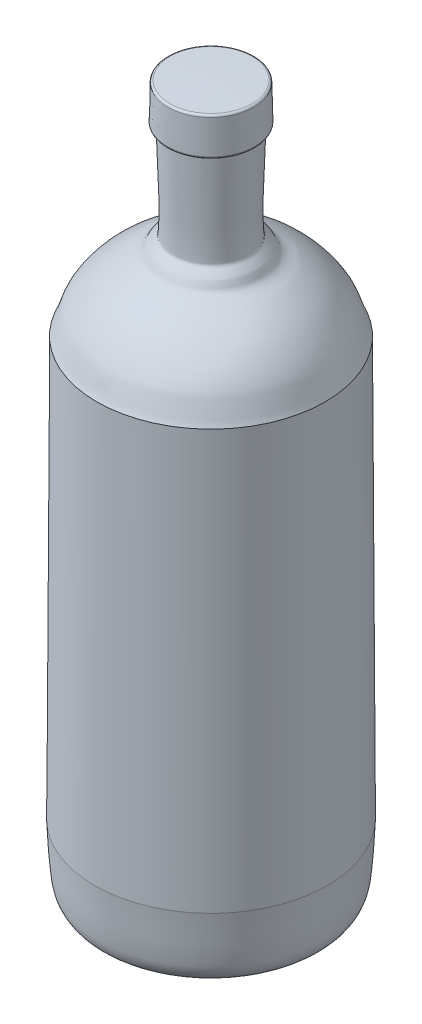
ISO-10303-21;
HEADER;
FILE_DESCRIPTION(('STEP AP214'),'2;1');
FILE_NAME('part.step','',(''),(''),'','','');
FILE_SCHEMA(('AUTOMOTIVE_DESIGN { 1 0 10303 214 1 1 1 1 }'));
ENDSEC;
DATA;
#1=APPLICATION_CONTEXT('core data for automotive mechanical design processes');
#2=APPLICATION_PROTOCOL_DEFINITION('international standard','automotive_design',2000,#1);
#3=PRODUCT_CONTEXT('',#1,'mechanical');
#4=PRODUCT('Part','Part','',(#3));
#5=PRODUCT_RELATED_PRODUCT_CATEGORY('part','',(#4));
#6=PRODUCT_DEFINITION_FORMATION('','',#4);
#7=PRODUCT_DEFINITION_CONTEXT('part definition',#1,'design');
#8=PRODUCT_DEFINITION('design','',#6,#7);
#9=PRODUCT_DEFINITION_SHAPE('','',#8);
#10=(LENGTH_UNIT() NAMED_UNIT(*) SI_UNIT(.MILLI.,.METRE.));
#11=(NAMED_UNIT(*) PLANE_ANGLE_UNIT() SI_UNIT($,.RADIAN.));
#12=(NAMED_UNIT(*) SI_UNIT($,.STERADIAN.) SOLID_ANGLE_UNIT());
#13=UNCERTAINTY_MEASURE_WITH_UNIT(LENGTH_MEASURE(1.E-05),#10,'distance_accuracy_value','');
#14=(GEOMETRIC_REPRESENTATION_CONTEXT(3) GLOBAL_UNCERTAINTY_ASSIGNED_CONTEXT((#13)) GLOBAL_UNIT_ASSIGNED_CONTEXT((#10,
#11,#12)) REPRESENTATION_CONTEXT('',''));
#15=CARTESIAN_POINT('',(0.,0.,0.));
#16=DIRECTION('',(0.,0.,1.));
#17=DIRECTION('',(1.,0.,0.));
#18=AXIS2_PLACEMENT_3D('',#15,#16,#17);
#19=CARTESIAN_POINT('',(177.,1023.88810937263,0.));
#20=DIRECTION('',(0.,1.,0.));
#21=DIRECTION('',(0.,0.,1.));
#22=AXIS2_PLACEMENT_3D('',#19,#20,#21);
#23=CONICAL_SURFACE('',#22,0.,0.163340722630226);
#24=CARTESIAN_POINT('',(177.,1024.10366090663,0.));
#25=DIRECTION('',(0.,1.,0.));
#26=DIRECTION('',(0.,0.,1.));
#27=AXIS2_PLACEMENT_3D('',#24,#25,#26);
#28=CIRCLE('',#27,0.0355248432508393);
#29=CARTESIAN_POINT('',(177.,1024.10366090663,0.0355248432508393));
#30=VERTEX_POINT('',#29);
#31=EDGE_CURVE('E11',#30,#30,#28,.T.);
#32=ORIENTED_EDGE('',*,*,#31,.T.);
#33=EDGE_LOOP('',(#32));
#34=FACE_BOUND('',#33,.T.);
#35=CARTESIAN_POINT('',(177.,1023.88810937263,0.));
#36=VERTEX_POINT('',#35);
#37=VERTEX_LOOP('',#36);
#38=FACE_BOUND('',#37,.T.);
#39=ADVANCED_FACE('F35',(#34,#38),#23,.F.);
#40=CARTESIAN_POINT('',(177.,1024.10366090663,0.));
#41=DIRECTION('',(0.,-1.,0.));
#42=DIRECTION('',(0.,0.,-1.));
#43=AXIS2_PLACEMENT_3D('',#40,#41,#42);
#44=CONICAL_SURFACE('',#43,0.0355248432508393,1.53802118239082);
#45=CARTESIAN_POINT('',(177.,1022.19669602103,0.));
#46=DIRECTION('',(0.,1.,0.));
#47=DIRECTION('',(0.,0.,1.));
#48=AXIS2_PLACEMENT_3D('',#45,#46,#47);
#49=CIRCLE('',#48,58.1979538539983);
#50=CARTESIAN_POINT('',(177.,1022.19669602103,58.1979538539983));
#51=VERTEX_POINT('',#50);
#52=EDGE_CURVE('E42',#51,#51,#49,.T.);
#53=ORIENTED_EDGE('',*,*,#52,.T.);
#54=EDGE_LOOP('',(#53));
#55=FACE_BOUND('',#54,.T.);
#56=ORIENTED_EDGE('',*,*,#31,.F.);
#57=EDGE_LOOP('',(#56));
#58=FACE_BOUND('',#57,.T.);
#59=ADVANCED_FACE('F84',(#55,#58),#44,.T.);
#60=CARTESIAN_POINT('',(177.,1019.19830719193,0.));
#61=DIRECTION('',(0.,1.,0.));
#62=DIRECTION('',(0.,0.,1.));
#63=AXIS2_PLACEMENT_3D('',#60,#61,#62);
#64=TOROIDAL_SURFACE('',#63,58.099646023536,2.99999999999997);
#65=CARTESIAN_POINT('',(177.,1019.26527255644,0.));
#66=DIRECTION('',(0.,1.,0.));
#67=DIRECTION('',(0.,0.,1.));
#68=AXIS2_PLACEMENT_3D('',#65,#66,#67);
#69=CIRCLE('',#68,61.0988985370726);
#70=CARTESIAN_POINT('',(177.,1019.26527255644,61.0988985370726));
#71=VERTEX_POINT('',#70);
#72=EDGE_CURVE('E79',#71,#71,#69,.T.);
#73=ORIENTED_EDGE('',*,*,#72,.T.);
#74=EDGE_LOOP('',(#73));
#75=FACE_BOUND('',#74,.T.);
#76=ORIENTED_EDGE('',*,*,#52,.F.);
#77=EDGE_LOOP('',(#76));
#78=FACE_BOUND('',#77,.T.);
#79=ADVANCED_FACE('F87',(#75,#78),#64,.T.);
#80=CARTESIAN_POINT('',(177.,1019.26527255644,0.));
#81=DIRECTION('',(0.,-1.,0.));
#82=DIRECTION('',(0.,0.,-1.));
#83=AXIS2_PLACEMENT_3D('',#80,#81,#82);
#84=CONICAL_SURFACE('',#83,61.0988985370726,0.0223236422692484);
#85=CARTESIAN_POINT('',(177.,971.677951881006,0.));
#86=DIRECTION('',(0.,1.,0.));
#87=DIRECTION('',(0.,0.,1.));
#88=AXIS2_PLACEMENT_3D('',#85,#86,#87);
#89=CIRCLE('',#88,62.161397363241);
#90=CARTESIAN_POINT('',(177.,971.677951881006,62.161397363241));
#91=VERTEX_POINT('',#90);
#92=EDGE_CURVE('E76',#91,#91,#89,.T.);
#93=ORIENTED_EDGE('',*,*,#92,.T.);
#94=EDGE_LOOP('',(#93));
#95=FACE_BOUND('',#94,.T.);
#96=ORIENTED_EDGE('',*,*,#72,.F.);
#97=EDGE_LOOP('',(#96));
#98=FACE_BOUND('',#97,.T.);
#99=ADVANCED_FACE('F89',(#95,#98),#84,.T.);
#100=CARTESIAN_POINT('',(177.,971.610986516497,0.));
#101=DIRECTION('',(0.,1.,0.));
#102=DIRECTION('',(0.,0.,1.));
#103=AXIS2_PLACEMENT_3D('',#100,#101,#102);
#104=TOROIDAL_SURFACE('',#103,59.1621448497043,3.00000000000005);
#105=CARTESIAN_POINT('',(177.,968.771936948293,0.));
#106=DIRECTION('',(0.,1.,0.));
#107=DIRECTION('',(0.,0.,1.));
#108=AXIS2_PLACEMENT_3D('',#105,#106,#107);
#109=CIRCLE('',#108,60.1315764095789);
#110=CARTESIAN_POINT('',(177.,968.771936948293,60.1315764095789));
#111=VERTEX_POINT('',#110);
#112=EDGE_CURVE('E73',#111,#111,#109,.T.);
#113=ORIENTED_EDGE('',*,*,#112,.T.);
#114=EDGE_LOOP('',(#113));
#115=FACE_BOUND('',#114,.T.);
#116=ORIENTED_EDGE('',*,*,#92,.F.);
#117=EDGE_LOOP('',(#116));
#118=FACE_BOUND('',#117,.T.);
#119=ADVANCED_FACE('F96',(#115,#118),#104,.T.);
#120=CARTESIAN_POINT('',(177.,968.771936948293,0.));
#121=DIRECTION('',(0.,1.,0.));
#122=DIRECTION('',(0.,0.,1.));
#123=AXIS2_PLACEMENT_3D('',#120,#121,#122);
#124=CONICAL_SURFACE('',#123,60.1315764095789,1.24174663195451);
#125=CARTESIAN_POINT('',(177.,967.758108914125,0.));
#126=DIRECTION('',(0.,1.,0.));
#127=DIRECTION('',(0.,0.,1.));
#128=AXIS2_PLACEMENT_3D('',#125,#126,#127);
#129=CIRCLE('',#128,57.1625085952287);
#130=CARTESIAN_POINT('',(177.,967.758108914125,57.1625085952287));
#131=VERTEX_POINT('',#130);
#132=EDGE_CURVE('E70',#131,#131,#129,.T.);
#133=ORIENTED_EDGE('',*,*,#132,.T.);
#134=EDGE_LOOP('',(#133));
#135=FACE_BOUND('',#134,.T.);
#136=ORIENTED_EDGE('',*,*,#112,.F.);
#137=EDGE_LOOP('',(#136));
#138=FACE_BOUND('',#137,.T.);
#139=ADVANCED_FACE('F127',(#135,#138),#124,.T.);
#140=CARTESIAN_POINT('',(177.,964.919059345921,0.));
#141=DIRECTION('',(0.,1.,0.));
#142=DIRECTION('',(0.,0.,1.));
#143=AXIS2_PLACEMENT_3D('',#140,#141,#142);
#144=TOROIDAL_SURFACE('',#143,58.1319401551034,2.99999999999999);
#145=CARTESIAN_POINT('',(177.,964.97338155987,0.));
#146=DIRECTION('',(0.,1.,0.));
#147=DIRECTION('',(0.,0.,1.));
#148=AXIS2_PLACEMENT_3D('',#145,#146,#147);
#149=CIRCLE('',#148,55.1324320125788);
#150=CARTESIAN_POINT('',(177.,964.97338155987,55.1324320125788));
#151=VERTEX_POINT('',#150);
#152=EDGE_CURVE('E60',#151,#151,#149,.T.);
#153=ORIENTED_EDGE('',*,*,#152,.T.);
#154=EDGE_LOOP('',(#153));
#155=FACE_BOUND('',#154,.T.);
#156=ORIENTED_EDGE('',*,*,#132,.F.);
#157=EDGE_LOOP('',(#156));
#158=FACE_BOUND('',#157,.T.);
#159=ADVANCED_FACE('F137',(#155,#158),#144,.F.);
#160=CARTESIAN_POINT('',(121.867567987421,964.97338155987,0.));
#161=CARTESIAN_POINT('',(122.550765948388,921.300609512248,0.));
#162=CARTESIAN_POINT('',(126.673177858447,877.546144248,0.));
#163=CARTESIAN_POINT('',(123.917161870321,833.955065416995,0.));
#164=CARTESIAN_POINT('',(123.574773092262,828.53960473769,0.));
#165=CARTESIAN_POINT('',(116.117568409443,826.352465608271,0.));
#166=CARTESIAN_POINT('',(112.830398448233,822.035179644781,0.));
#167=CARTESIAN_POINT('',(110.025107714772,818.350781682398,0.));
#168=CARTESIAN_POINT('',(109.332407543859,813.012775998171,0.));
#169=CARTESIAN_POINT('',(105.743529771949,810.086276248858,0.));
#170=CARTESIAN_POINT('',(99.269721473607,804.807300600677,0.));
#171=CARTESIAN_POINT('',(90.6205132309439,802.860085166278,0.));
#172=CARTESIAN_POINT('',(83.657055798899,798.246188941839,0.));
#173=CARTESIAN_POINT('',(73.152898477094,791.28627107332,0.));
#174=CARTESIAN_POINT('',(62.4654407618663,784.30959906818,0.));
#175=CARTESIAN_POINT('',(53.4909938690411,775.464426331279,0.));
#176=CARTESIAN_POINT('',(44.1835910297633,766.291093776247,0.));
#177=CARTESIAN_POINT('',(35.7396883579718,755.991823379657,0.));
#178=CARTESIAN_POINT('',(29.2667388104729,744.639347793544,0.));
#179=CARTESIAN_POINT('',(22.7350955142782,733.183933146306,0.));
#180=CARTESIAN_POINT('',(20.9813700353719,719.493328882866,0.));
#181=CARTESIAN_POINT('',(14.9986941808531,707.741883077829,0.));
#182=B_SPLINE_CURVE_WITH_KNOTS('',3,(#160,#161,#162,#163,#164,#165,#166,#167,#168,#169,#170,
#171,#172,#173,#174,#175,#176,#177,#178,#179,#180,#181),.UNSPECIFIED.,.F.,.F.,(4,3,3,3,3,3,3,4),
(0.,1.,2.,3.,4.,5.,6.,7.),.UNSPECIFIED.);
#183=CARTESIAN_POINT('',(177.,1120.9717606604,0.));
#184=DIRECTION('',(0.,1.,0.));
#185=AXIS1_PLACEMENT('',#183,#184);
#186=SURFACE_OF_REVOLUTION('',#182,#185);
#187=CARTESIAN_POINT('',(177.,707.741883077829,0.));
#188=DIRECTION('',(0.,1.,0.));
#189=DIRECTION('',(0.,0.,1.));
#190=AXIS2_PLACEMENT_3D('',#187,#188,#189);
#191=CIRCLE('',#190,162.001305819147);
#192=CARTESIAN_POINT('',(177.,707.741883077829,162.001305819147));
#193=VERTEX_POINT('',#192);
#194=EDGE_CURVE('E57',#193,#193,#191,.T.);
#195=ORIENTED_EDGE('',*,*,#194,.T.);
#196=EDGE_LOOP('',(#195));
#197=FACE_BOUND('',#196,.T.);
#198=ORIENTED_EDGE('',*,*,#152,.F.);
#199=EDGE_LOOP('',(#198));
#200=FACE_BOUND('',#199,.T.);
#201=ADVANCED_FACE('F147',(#197,#200),#186,.F.);
#202=CARTESIAN_POINT('',(177.,707.741883077829,0.));
#203=DIRECTION('',(0.,-1.,0.));
#204=DIRECTION('',(0.,0.,-1.));
#205=AXIS2_PLACEMENT_3D('',#202,#203,#204);
#206=CONICAL_SURFACE('',#205,162.001305819147,0.00505897876338988);
#207=CARTESIAN_POINT('',(177.,114.999999999963,0.));
#208=DIRECTION('',(0.,1.,0.));
#209=DIRECTION('',(0.,0.,1.));
#210=AXIS2_PLACEMENT_3D('',#207,#208,#209);
#211=CIRCLE('',#210,164.999999999979);
#212=CARTESIAN_POINT('',(177.,114.999999999963,164.999999999979));
#213=VERTEX_POINT('',#212);
#214=EDGE_CURVE('E55',#213,#213,#211,.T.);
#215=ORIENTED_EDGE('',*,*,#214,.T.);
#216=EDGE_LOOP('',(#215));
#217=FACE_BOUND('',#216,.T.);
#218=ORIENTED_EDGE('',*,*,#194,.F.);
#219=EDGE_LOOP('',(#218));
#220=FACE_BOUND('',#219,.T.);
#221=ADVANCED_FACE('F51',(#217,#220),#206,.T.);
#222=CARTESIAN_POINT('',(12.0000000000207,114.999999999963,0.));
#223=CARTESIAN_POINT('',(13.6666666666886,91.9999999999666,0.));
#224=CARTESIAN_POINT('',(13.6299382244633,68.8127258653003,0.));
#225=CARTESIAN_POINT('',(17.0000000000243,45.9999999999748,0.));
#226=CARTESIAN_POINT('',(18.0042595717715,39.2019352066118,0.));
#227=CARTESIAN_POINT('',(20.402979586204,32.1078004597779,0.));
#228=CARTESIAN_POINT('',(25.0000000000241,26.9999999999785,0.));
#229=CARTESIAN_POINT('',(29.8955950433998,21.560449951784,0.));
#230=CARTESIAN_POINT('',(37.6290765167332,19.6009567514049,0.));
#231=CARTESIAN_POINT('',(44.0000000000216,15.9999999999816,0.));
#232=CARTESIAN_POINT('',(64.1531094977669,4.60911202299683,0.));
#233=CARTESIAN_POINT('',(102.483605349515,5.86294619344972,0.));
#234=CARTESIAN_POINT('',(114.000000000011,3.99999999998805,0.));
#235=CARTESIAN_POINT('',(134.786920124817,0.637409979800186,0.));
#236=CARTESIAN_POINT('',(155.865875344083,-0.0496070150069251,0.));
#237=CARTESIAN_POINT('',(177.,0.348553443274115,0.));
#238=B_SPLINE_CURVE_WITH_KNOTS('',3,(#222,#223,#224,#225,#226,#227,#228,#229,#230,#231,#232,
#233,#234,#235,#236,#237),.UNSPECIFIED.,.F.,.F.,(4,3,3,3,3,4),(3.48221891866585,
4.48221891866585,5.48221891866585,6.48221891866585,7.48221891866585,8.),.UNSPECIFIED.);
#239=CARTESIAN_POINT('',(177.,1120.9717606604,0.));
#240=DIRECTION('',(0.,1.,0.));
#241=AXIS1_PLACEMENT('',#239,#240);
#242=SURFACE_OF_REVOLUTION('',#238,#241);
#243=CARTESIAN_POINT('',(177.,0.348553443274115,0.));
#244=VERTEX_POINT('',#243);
#245=VERTEX_LOOP('',#244);
#246=FACE_BOUND('',#245,.T.);
#247=ORIENTED_EDGE('',*,*,#214,.F.);
#248=EDGE_LOOP('',(#247));
#249=FACE_BOUND('',#248,.T.);
#250=ADVANCED_FACE('F48',(#246,#249),#242,.F.);
#251=CLOSED_SHELL('',(#39,#59,#79,#99,#119,#139,#159,#201,#221,#250));
#252=MANIFOLD_SOLID_BREP('B2',#251);
#253=ADVANCED_BREP_SHAPE_REPRESENTATION('',(#18,#252),#14);
#254=SHAPE_DEFINITION_REPRESENTATION(#9,#253);
ENDSEC;
END-ISO-10303-21;
